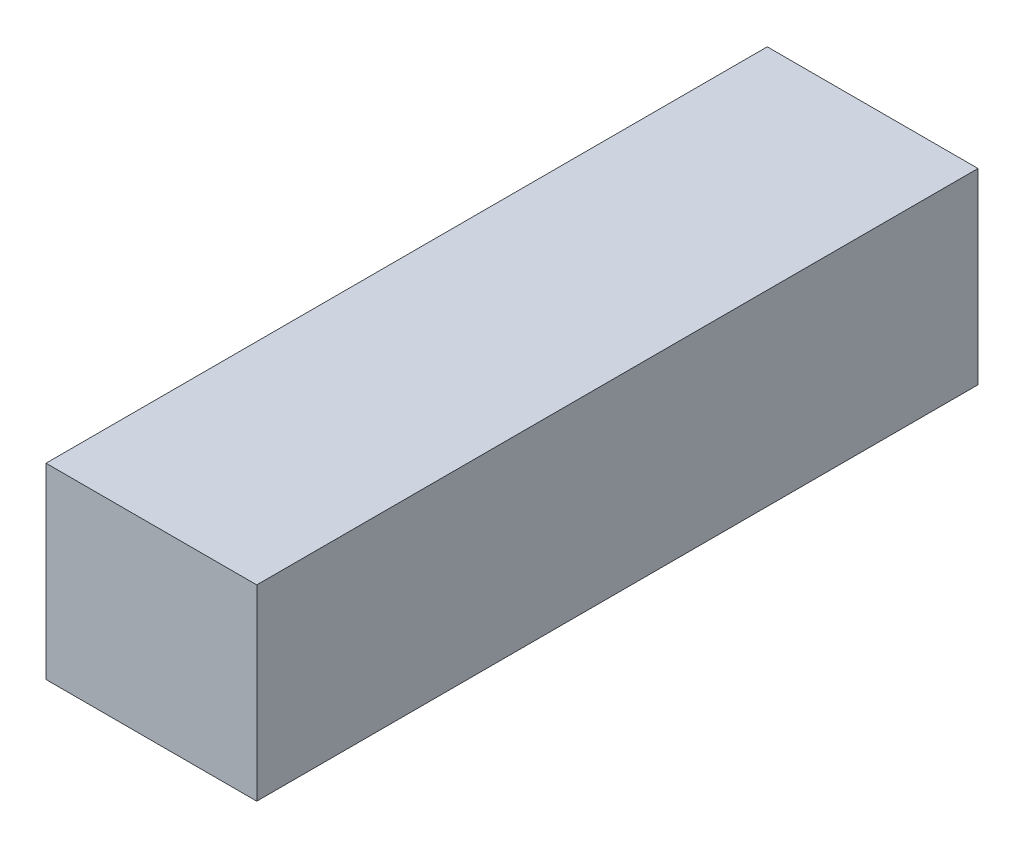
ISO-10303-21;
HEADER;
FILE_DESCRIPTION(('STEP AP214'),'2;1');
FILE_NAME('part.step','',(''),(''),'','','');
FILE_SCHEMA(('AUTOMOTIVE_DESIGN { 1 0 10303 214 1 1 1 1 }'));
ENDSEC;
DATA;
#1=APPLICATION_CONTEXT('core data for automotive mechanical design processes');
#2=APPLICATION_PROTOCOL_DEFINITION('international standard','automotive_design',2000,#1);
#3=PRODUCT_CONTEXT('',#1,'mechanical');
#4=PRODUCT('Part','Part','',(#3));
#5=PRODUCT_RELATED_PRODUCT_CATEGORY('part','',(#4));
#6=PRODUCT_DEFINITION_FORMATION('','',#4);
#7=PRODUCT_DEFINITION_CONTEXT('part definition',#1,'design');
#8=PRODUCT_DEFINITION('design','',#6,#7);
#9=PRODUCT_DEFINITION_SHAPE('','',#8);
#10=(LENGTH_UNIT() NAMED_UNIT(*) SI_UNIT(.MILLI.,.METRE.));
#11=(NAMED_UNIT(*) PLANE_ANGLE_UNIT() SI_UNIT($,.RADIAN.));
#12=(NAMED_UNIT(*) SI_UNIT($,.STERADIAN.) SOLID_ANGLE_UNIT());
#13=UNCERTAINTY_MEASURE_WITH_UNIT(LENGTH_MEASURE(1.E-05),#10,'distance_accuracy_value','');
#14=(GEOMETRIC_REPRESENTATION_CONTEXT(3) GLOBAL_UNCERTAINTY_ASSIGNED_CONTEXT((#13)) GLOBAL_UNIT_ASSIGNED_CONTEXT((#10,
#11,#12)) REPRESENTATION_CONTEXT('',''));
#15=CARTESIAN_POINT('',(0.,0.,0.));
#16=DIRECTION('',(0.,0.,1.));
#17=DIRECTION('',(1.,0.,0.));
#18=AXIS2_PLACEMENT_3D('',#15,#16,#17);
#19=CARTESIAN_POINT('',(22.5,-20.,154.));
#20=DIRECTION('',(-1.,0.,0.));
#21=DIRECTION('',(0.,0.,1.));
#22=AXIS2_PLACEMENT_3D('',#19,#20,#21);
#23=PLANE('',#22);
#24=DIRECTION('',(0.,1.,0.));
#25=VECTOR('',#24,1.);
#26=CARTESIAN_POINT('',(22.5,-20.,0.));
#27=LINE('',#26,#25);
#28=CARTESIAN_POINT('',(22.5,-20.,0.));
#29=VERTEX_POINT('',#28);
#30=CARTESIAN_POINT('',(22.5,20.,0.));
#31=VERTEX_POINT('',#30);
#32=EDGE_CURVE('E113',#29,#31,#27,.T.);
#33=ORIENTED_EDGE('',*,*,#32,.T.);
#34=DIRECTION('',(0.,0.,-1.));
#35=VECTOR('',#34,1.);
#36=CARTESIAN_POINT('',(22.5,20.,154.));
#37=LINE('',#36,#35);
#38=CARTESIAN_POINT('',(22.5,20.,154.));
#39=VERTEX_POINT('',#38);
#40=EDGE_CURVE('E11',#39,#31,#37,.T.);
#41=ORIENTED_EDGE('',*,*,#40,.F.);
#42=DIRECTION('',(0.,1.,0.));
#43=VECTOR('',#42,1.);
#44=CARTESIAN_POINT('',(22.5,-20.,154.));
#45=LINE('',#44,#43);
#46=CARTESIAN_POINT('',(22.5,-20.,154.));
#47=VERTEX_POINT('',#46);
#48=EDGE_CURVE('E97',#47,#39,#45,.T.);
#49=ORIENTED_EDGE('',*,*,#48,.F.);
#50=DIRECTION('',(0.,0.,-1.));
#51=VECTOR('',#50,1.);
#52=CARTESIAN_POINT('',(22.5,-20.,154.));
#53=LINE('',#52,#51);
#54=EDGE_CURVE('E109',#47,#29,#53,.T.);
#55=ORIENTED_EDGE('',*,*,#54,.T.);
#56=EDGE_LOOP('',(#33,#41,#49,#55));
#57=FACE_BOUND('',#56,.T.);
#58=ADVANCED_FACE('F45',(#57),#23,.F.);
#59=CARTESIAN_POINT('',(-22.5,20.,154.));
#60=DIRECTION('',(0.,-1.,0.));
#61=DIRECTION('',(0.,0.,-1.));
#62=AXIS2_PLACEMENT_3D('',#59,#60,#61);
#63=PLANE('',#62);
#64=DIRECTION('',(-1.,0.,0.));
#65=VECTOR('',#64,1.);
#66=CARTESIAN_POINT('',(-22.5,20.,0.));
#67=LINE('',#66,#65);
#68=CARTESIAN_POINT('',(-22.5,20.,0.));
#69=VERTEX_POINT('',#68);
#70=EDGE_CURVE('E102',#31,#69,#67,.T.);
#71=ORIENTED_EDGE('',*,*,#70,.T.);
#72=DIRECTION('',(0.,0.,-1.));
#73=VECTOR('',#72,1.);
#74=CARTESIAN_POINT('',(-22.5,20.,154.));
#75=LINE('',#74,#73);
#76=CARTESIAN_POINT('',(-22.5,20.,154.));
#77=VERTEX_POINT('',#76);
#78=EDGE_CURVE('E54',#77,#69,#75,.T.);
#79=ORIENTED_EDGE('',*,*,#78,.F.);
#80=DIRECTION('',(-1.,0.,0.));
#81=VECTOR('',#80,1.);
#82=CARTESIAN_POINT('',(-22.5,20.,154.));
#83=LINE('',#82,#81);
#84=EDGE_CURVE('E92',#39,#77,#83,.T.);
#85=ORIENTED_EDGE('',*,*,#84,.F.);
#86=ORIENTED_EDGE('',*,*,#40,.T.);
#87=EDGE_LOOP('',(#71,#79,#85,#86));
#88=FACE_BOUND('',#87,.T.);
#89=ADVANCED_FACE('F101',(#88),#63,.F.);
#90=CARTESIAN_POINT('',(-22.5,-20.,154.));
#91=DIRECTION('',(1.,0.,0.));
#92=DIRECTION('',(0.,0.,-1.));
#93=AXIS2_PLACEMENT_3D('',#90,#91,#92);
#94=PLANE('',#93);
#95=DIRECTION('',(0.,-1.,0.));
#96=VECTOR('',#95,1.);
#97=CARTESIAN_POINT('',(-22.5,-20.,0.));
#98=LINE('',#97,#96);
#99=CARTESIAN_POINT('',(-22.5,-20.,0.));
#100=VERTEX_POINT('',#99);
#101=EDGE_CURVE('E79',#69,#100,#98,.T.);
#102=ORIENTED_EDGE('',*,*,#101,.T.);
#103=DIRECTION('',(0.,0.,-1.));
#104=VECTOR('',#103,1.);
#105=CARTESIAN_POINT('',(-22.5,-20.,154.));
#106=LINE('',#105,#104);
#107=CARTESIAN_POINT('',(-22.5,-20.,154.));
#108=VERTEX_POINT('',#107);
#109=EDGE_CURVE('E104',#108,#100,#106,.T.);
#110=ORIENTED_EDGE('',*,*,#109,.F.);
#111=DIRECTION('',(0.,-1.,0.));
#112=VECTOR('',#111,1.);
#113=CARTESIAN_POINT('',(-22.5,-20.,154.));
#114=LINE('',#113,#112);
#115=EDGE_CURVE('E95',#77,#108,#114,.T.);
#116=ORIENTED_EDGE('',*,*,#115,.F.);
#117=ORIENTED_EDGE('',*,*,#78,.T.);
#118=EDGE_LOOP('',(#102,#110,#116,#117));
#119=FACE_BOUND('',#118,.T.);
#120=ADVANCED_FACE('F105',(#119),#94,.F.);
#121=CARTESIAN_POINT('',(-22.5,-20.,154.));
#122=DIRECTION('',(0.,1.,0.));
#123=DIRECTION('',(0.,0.,1.));
#124=AXIS2_PLACEMENT_3D('',#121,#122,#123);
#125=PLANE('',#124);
#126=DIRECTION('',(1.,0.,0.));
#127=VECTOR('',#126,1.);
#128=CARTESIAN_POINT('',(-22.5,-20.,0.));
#129=LINE('',#128,#127);
#130=EDGE_CURVE('E85',#100,#29,#129,.T.);
#131=ORIENTED_EDGE('',*,*,#130,.T.);
#132=ORIENTED_EDGE('',*,*,#54,.F.);
#133=DIRECTION('',(1.,0.,0.));
#134=VECTOR('',#133,1.);
#135=CARTESIAN_POINT('',(-22.5,-20.,154.));
#136=LINE('',#135,#134);
#137=EDGE_CURVE('E62',#108,#47,#136,.T.);
#138=ORIENTED_EDGE('',*,*,#137,.F.);
#139=ORIENTED_EDGE('',*,*,#109,.T.);
#140=EDGE_LOOP('',(#131,#132,#138,#139));
#141=FACE_BOUND('',#140,.T.);
#142=ADVANCED_FACE('F126',(#141),#125,.F.);
#143=CARTESIAN_POINT('',(0.,0.,154.));
#144=DIRECTION('',(0.,0.,-1.));
#145=DIRECTION('',(-1.,0.,0.));
#146=AXIS2_PLACEMENT_3D('',#143,#144,#145);
#147=PLANE('',#146);
#148=ORIENTED_EDGE('',*,*,#48,.T.);
#149=ORIENTED_EDGE('',*,*,#84,.T.);
#150=ORIENTED_EDGE('',*,*,#115,.T.);
#151=ORIENTED_EDGE('',*,*,#137,.T.);
#152=EDGE_LOOP('',(#148,#149,#150,#151));
#153=FACE_BOUND('',#152,.T.);
#154=ADVANCED_FACE('F93',(#153),#147,.F.);
#155=CARTESIAN_POINT('',(0.,0.,0.));
#156=DIRECTION('',(0.,0.,-1.));
#157=DIRECTION('',(-1.,0.,0.));
#158=AXIS2_PLACEMENT_3D('',#155,#156,#157);
#159=PLANE('',#158);
#160=ORIENTED_EDGE('',*,*,#32,.F.);
#161=ORIENTED_EDGE('',*,*,#130,.F.);
#162=ORIENTED_EDGE('',*,*,#101,.F.);
#163=ORIENTED_EDGE('',*,*,#70,.F.);
#164=EDGE_LOOP('',(#160,#161,#162,#163));
#165=FACE_BOUND('',#164,.T.);
#166=ADVANCED_FACE('F129',(#165),#159,.T.);
#167=CLOSED_SHELL('',(#58,#89,#120,#142,#154,#166));
#168=MANIFOLD_SOLID_BREP('B2',#167);
#169=ADVANCED_BREP_SHAPE_REPRESENTATION('',(#18,#168),#14);
#170=SHAPE_DEFINITION_REPRESENTATION(#9,#169);
ENDSEC;
END-ISO-10303-21;
